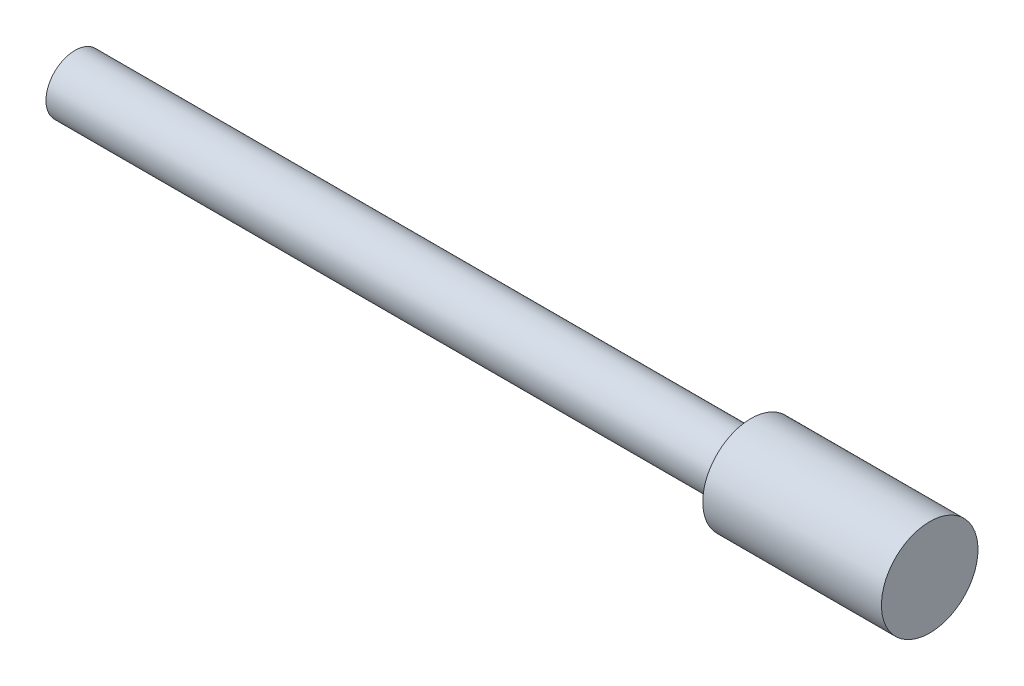
ISO-10303-21;
HEADER;
FILE_DESCRIPTION(('STEP AP214'),'2;1');
FILE_NAME('part.step','',(''),(''),'','','');
FILE_SCHEMA(('AUTOMOTIVE_DESIGN { 1 0 10303 214 1 1 1 1 }'));
ENDSEC;
DATA;
#1=APPLICATION_CONTEXT('core data for automotive mechanical design processes');
#2=APPLICATION_PROTOCOL_DEFINITION('international standard','automotive_design',2000,#1);
#3=PRODUCT_CONTEXT('',#1,'mechanical');
#4=PRODUCT('Part','Part','',(#3));
#5=PRODUCT_RELATED_PRODUCT_CATEGORY('part','',(#4));
#6=PRODUCT_DEFINITION_FORMATION('','',#4);
#7=PRODUCT_DEFINITION_CONTEXT('part definition',#1,'design');
#8=PRODUCT_DEFINITION('design','',#6,#7);
#9=PRODUCT_DEFINITION_SHAPE('','',#8);
#10=(LENGTH_UNIT() NAMED_UNIT(*) SI_UNIT(.MILLI.,.METRE.));
#11=(NAMED_UNIT(*) PLANE_ANGLE_UNIT() SI_UNIT($,.RADIAN.));
#12=(NAMED_UNIT(*) SI_UNIT($,.STERADIAN.) SOLID_ANGLE_UNIT());
#13=UNCERTAINTY_MEASURE_WITH_UNIT(LENGTH_MEASURE(1.E-05),#10,'distance_accuracy_value','');
#14=(GEOMETRIC_REPRESENTATION_CONTEXT(3) GLOBAL_UNCERTAINTY_ASSIGNED_CONTEXT((#13)) GLOBAL_UNIT_ASSIGNED_CONTEXT((#10,
#11,#12)) REPRESENTATION_CONTEXT('',''));
#15=CARTESIAN_POINT('',(0.,0.,0.));
#16=DIRECTION('',(0.,0.,1.));
#17=DIRECTION('',(1.,0.,0.));
#18=AXIS2_PLACEMENT_3D('',#15,#16,#17);
#19=CARTESIAN_POINT('',(140.,0.,0.));
#20=DIRECTION('',(-1.,0.,0.));
#21=DIRECTION('',(0.,0.,1.));
#22=AXIS2_PLACEMENT_3D('',#19,#20,#21);
#23=CYLINDRICAL_SURFACE('',#22,6.);
#24=CARTESIAN_POINT('',(140.,0.,0.));
#25=DIRECTION('',(1.,0.,0.));
#26=DIRECTION('',(0.,0.,-1.));
#27=AXIS2_PLACEMENT_3D('',#24,#25,#26);
#28=CIRCLE('',#27,6.);
#29=CARTESIAN_POINT('',(140.,0.,-6.));
#30=VERTEX_POINT('',#29);
#31=EDGE_CURVE('E10',#30,#30,#28,.T.);
#32=ORIENTED_EDGE('',*,*,#31,.F.);
#33=EDGE_LOOP('',(#32));
#34=FACE_BOUND('',#33,.T.);
#35=CARTESIAN_POINT('',(0.,0.,0.));
#36=DIRECTION('',(1.,0.,0.));
#37=DIRECTION('',(0.,0.,-1.));
#38=AXIS2_PLACEMENT_3D('',#35,#36,#37);
#39=CIRCLE('',#38,6.);
#40=CARTESIAN_POINT('',(0.,0.,-6.));
#41=VERTEX_POINT('',#40);
#42=EDGE_CURVE('E42',#41,#41,#39,.T.);
#43=ORIENTED_EDGE('',*,*,#42,.T.);
#44=EDGE_LOOP('',(#43));
#45=FACE_BOUND('',#44,.T.);
#46=ADVANCED_FACE('F39',(#34,#45),#23,.T.);
#47=CARTESIAN_POINT('',(0.,0.,0.));
#48=DIRECTION('',(1.,0.,0.));
#49=DIRECTION('',(0.,0.,-1.));
#50=AXIS2_PLACEMENT_3D('',#47,#48,#49);
#51=PLANE('',#50);
#52=ORIENTED_EDGE('',*,*,#42,.F.);
#53=EDGE_LOOP('',(#52));
#54=FACE_BOUND('',#53,.T.);
#55=ADVANCED_FACE('F66',(#54),#51,.F.);
#56=CARTESIAN_POINT('',(177.,0.,0.));
#57=DIRECTION('',(-1.,0.,0.));
#58=DIRECTION('',(0.,0.,1.));
#59=AXIS2_PLACEMENT_3D('',#56,#57,#58);
#60=CYLINDRICAL_SURFACE('',#59,10.);
#61=CARTESIAN_POINT('',(177.,0.,0.));
#62=DIRECTION('',(1.,0.,0.));
#63=DIRECTION('',(0.,0.,-1.));
#64=AXIS2_PLACEMENT_3D('',#61,#62,#63);
#65=CIRCLE('',#64,10.);
#66=CARTESIAN_POINT('',(177.,0.,-10.));
#67=VERTEX_POINT('',#66);
#68=EDGE_CURVE('E51',#67,#67,#65,.T.);
#69=ORIENTED_EDGE('',*,*,#68,.F.);
#70=EDGE_LOOP('',(#69));
#71=FACE_BOUND('',#70,.T.);
#72=CARTESIAN_POINT('',(140.,0.,0.));
#73=DIRECTION('',(1.,0.,0.));
#74=DIRECTION('',(0.,0.,-1.));
#75=AXIS2_PLACEMENT_3D('',#72,#73,#74);
#76=CIRCLE('',#75,10.);
#77=CARTESIAN_POINT('',(140.,0.,-10.));
#78=VERTEX_POINT('',#77);
#79=EDGE_CURVE('E53',#78,#78,#76,.T.);
#80=ORIENTED_EDGE('',*,*,#79,.T.);
#81=EDGE_LOOP('',(#80));
#82=FACE_BOUND('',#81,.T.);
#83=ADVANCED_FACE('F63',(#71,#82),#60,.T.);
#84=CARTESIAN_POINT('',(177.,0.,0.));
#85=DIRECTION('',(1.,0.,0.));
#86=DIRECTION('',(0.,0.,-1.));
#87=AXIS2_PLACEMENT_3D('',#84,#85,#86);
#88=PLANE('',#87);
#89=ORIENTED_EDGE('',*,*,#68,.T.);
#90=EDGE_LOOP('',(#89));
#91=FACE_BOUND('',#90,.T.);
#92=ADVANCED_FACE('F61',(#91),#88,.T.);
#93=CARTESIAN_POINT('',(140.,0.,0.));
#94=DIRECTION('',(1.,0.,0.));
#95=DIRECTION('',(0.,0.,-1.));
#96=AXIS2_PLACEMENT_3D('',#93,#94,#95);
#97=PLANE('',#96);
#98=ORIENTED_EDGE('',*,*,#31,.T.);
#99=EDGE_LOOP('',(#98));
#100=FACE_BOUND('',#99,.T.);
#101=ORIENTED_EDGE('',*,*,#79,.F.);
#102=EDGE_LOOP('',(#101));
#103=FACE_BOUND('',#102,.T.);
#104=ADVANCED_FACE('F70',(#100,#103),#97,.F.);
#105=CLOSED_SHELL('',(#46,#55,#83,#92,#104));
#106=MANIFOLD_SOLID_BREP('B2',#105);
#107=ADVANCED_BREP_SHAPE_REPRESENTATION('',(#18,#106),#14);
#108=SHAPE_DEFINITION_REPRESENTATION(#9,#107);
ENDSEC;
END-ISO-10303-21;
